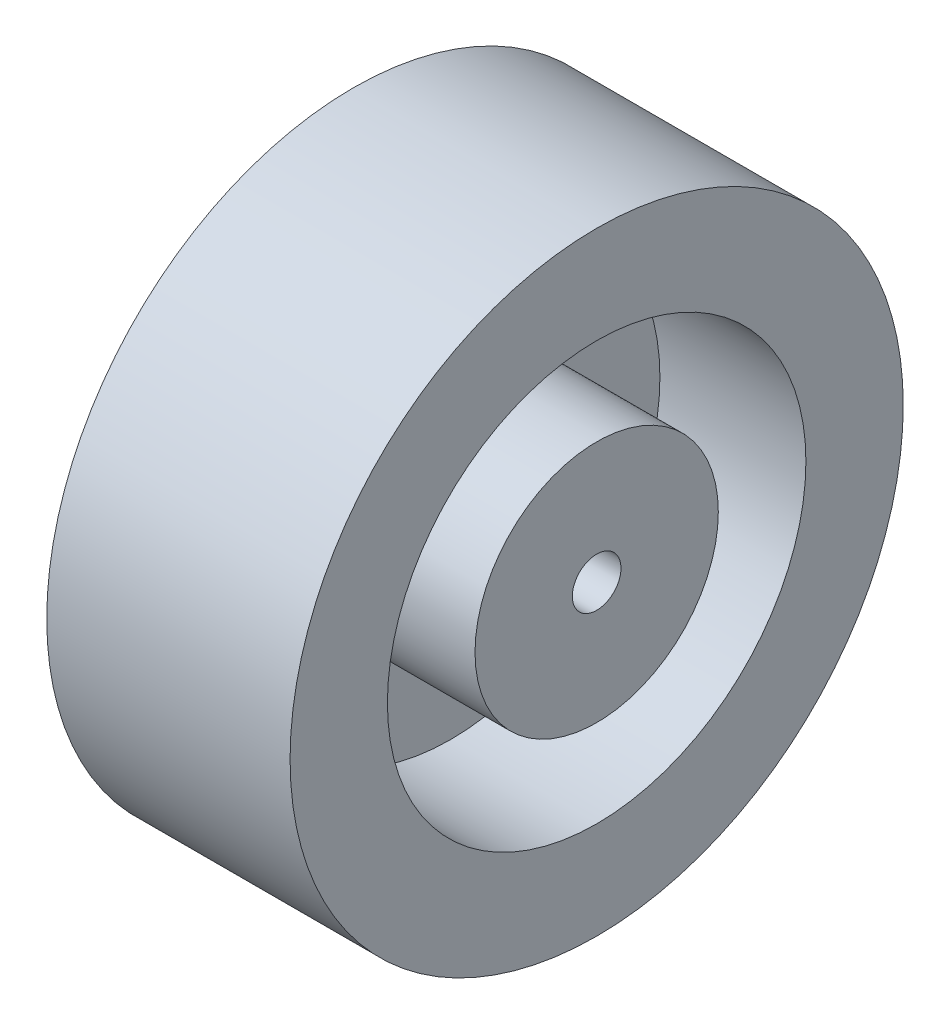
ISO-10303-21;
HEADER;
FILE_DESCRIPTION(('STEP AP214'),'2;1');
FILE_NAME('part.step','',(''),(''),'','','');
FILE_SCHEMA(('AUTOMOTIVE_DESIGN { 1 0 10303 214 1 1 1 1 }'));
ENDSEC;
DATA;
#1=APPLICATION_CONTEXT('core data for automotive mechanical design processes');
#2=APPLICATION_PROTOCOL_DEFINITION('international standard','automotive_design',2000,#1);
#3=PRODUCT_CONTEXT('',#1,'mechanical');
#4=PRODUCT('Part','Part','',(#3));
#5=PRODUCT_RELATED_PRODUCT_CATEGORY('part','',(#4));
#6=PRODUCT_DEFINITION_FORMATION('','',#4);
#7=PRODUCT_DEFINITION_CONTEXT('part definition',#1,'design');
#8=PRODUCT_DEFINITION('design','',#6,#7);
#9=PRODUCT_DEFINITION_SHAPE('','',#8);
#10=(LENGTH_UNIT() NAMED_UNIT(*) SI_UNIT(.MILLI.,.METRE.));
#11=(NAMED_UNIT(*) PLANE_ANGLE_UNIT() SI_UNIT($,.RADIAN.));
#12=(NAMED_UNIT(*) SI_UNIT($,.STERADIAN.) SOLID_ANGLE_UNIT());
#13=UNCERTAINTY_MEASURE_WITH_UNIT(LENGTH_MEASURE(1.E-05),#10,'distance_accuracy_value','');
#14=(GEOMETRIC_REPRESENTATION_CONTEXT(3) GLOBAL_UNCERTAINTY_ASSIGNED_CONTEXT((#13)) GLOBAL_UNIT_ASSIGNED_CONTEXT((#10,
#11,#12)) REPRESENTATION_CONTEXT('',''));
#15=CARTESIAN_POINT('',(0.,0.,0.));
#16=DIRECTION('',(0.,0.,1.));
#17=DIRECTION('',(1.,0.,0.));
#18=AXIS2_PLACEMENT_3D('',#15,#16,#17);
#19=CARTESIAN_POINT('',(25.,0.,0.));
#20=DIRECTION('',(1.,0.,0.));
#21=DIRECTION('',(0.,0.,-1.));
#22=AXIS2_PLACEMENT_3D('',#19,#20,#21);
#23=PLANE('',#22);
#24=CARTESIAN_POINT('',(25.,0.,0.));
#25=DIRECTION('',(1.,0.,0.));
#26=DIRECTION('',(0.,0.,-1.));
#27=AXIS2_PLACEMENT_3D('',#24,#25,#26);
#28=CIRCLE('',#27,12.5);
#29=CARTESIAN_POINT('',(25.,0.,-12.5));
#30=VERTEX_POINT('',#29);
#31=EDGE_CURVE('E65',#30,#30,#28,.F.);
#32=ORIENTED_EDGE('',*,*,#31,.F.);
#33=EDGE_LOOP('',(#32));
#34=FACE_BOUND('',#33,.T.);
#35=CARTESIAN_POINT('',(25.,0.,0.));
#36=DIRECTION('',(-1.,0.,0.));
#37=DIRECTION('',(0.,0.,1.));
#38=AXIS2_PLACEMENT_3D('',#35,#36,#37);
#39=CIRCLE('',#38,2.5);
#40=CARTESIAN_POINT('',(25.,0.,2.5));
#41=VERTEX_POINT('',#40);
#42=EDGE_CURVE('E57',#41,#41,#39,.T.);
#43=ORIENTED_EDGE('',*,*,#42,.T.);
#44=EDGE_LOOP('',(#43));
#45=FACE_BOUND('',#44,.T.);
#46=ADVANCED_FACE('F46',(#34,#45),#23,.T.);
#47=CARTESIAN_POINT('',(25.,0.,0.));
#48=DIRECTION('',(-1.,0.,0.));
#49=DIRECTION('',(0.,0.,1.));
#50=AXIS2_PLACEMENT_3D('',#47,#48,#49);
#51=CYLINDRICAL_SURFACE('',#50,31.5);
#52=CARTESIAN_POINT('',(25.,0.,0.));
#53=DIRECTION('',(1.,0.,0.));
#54=DIRECTION('',(0.,0.,-1.));
#55=AXIS2_PLACEMENT_3D('',#52,#53,#54);
#56=CIRCLE('',#55,31.5);
#57=CARTESIAN_POINT('',(25.,0.,-31.5));
#58=VERTEX_POINT('',#57);
#59=EDGE_CURVE('E10',#58,#58,#56,.T.);
#60=ORIENTED_EDGE('',*,*,#59,.F.);
#61=EDGE_LOOP('',(#60));
#62=FACE_BOUND('',#61,.T.);
#63=CARTESIAN_POINT('',(0.,0.,0.));
#64=DIRECTION('',(1.,0.,0.));
#65=DIRECTION('',(0.,0.,-1.));
#66=AXIS2_PLACEMENT_3D('',#63,#64,#65);
#67=CIRCLE('',#66,31.5);
#68=CARTESIAN_POINT('',(0.,0.,-31.5));
#69=VERTEX_POINT('',#68);
#70=EDGE_CURVE('E50',#69,#69,#67,.T.);
#71=ORIENTED_EDGE('',*,*,#70,.T.);
#72=EDGE_LOOP('',(#71));
#73=FACE_BOUND('',#72,.T.);
#74=ADVANCED_FACE('F48',(#62,#73),#51,.T.);
#75=CARTESIAN_POINT('',(25.,0.,0.));
#76=DIRECTION('',(1.,0.,0.));
#77=DIRECTION('',(0.,0.,-1.));
#78=AXIS2_PLACEMENT_3D('',#75,#76,#77);
#79=CIRCLE('',#78,21.5);
#80=CARTESIAN_POINT('',(25.,0.,-21.5));
#81=VERTEX_POINT('',#80);
#82=EDGE_CURVE('E62',#81,#81,#79,.T.);
#83=ORIENTED_EDGE('',*,*,#82,.F.);
#84=EDGE_LOOP('',(#83));
#85=FACE_BOUND('',#84,.T.);
#86=ORIENTED_EDGE('',*,*,#59,.T.);
#87=EDGE_LOOP('',(#86));
#88=FACE_BOUND('',#87,.T.);
#89=ADVANCED_FACE('F98',(#85,#88),#23,.T.);
#90=CARTESIAN_POINT('',(0.,0.,0.));
#91=DIRECTION('',(1.,0.,0.));
#92=DIRECTION('',(0.,0.,-1.));
#93=AXIS2_PLACEMENT_3D('',#90,#91,#92);
#94=PLANE('',#93);
#95=CARTESIAN_POINT('',(0.,0.,0.));
#96=DIRECTION('',(-1.,0.,0.));
#97=DIRECTION('',(0.,0.,1.));
#98=AXIS2_PLACEMENT_3D('',#95,#96,#97);
#99=CIRCLE('',#98,2.5);
#100=CARTESIAN_POINT('',(0.,0.,2.5));
#101=VERTEX_POINT('',#100);
#102=EDGE_CURVE('E59',#101,#101,#99,.T.);
#103=ORIENTED_EDGE('',*,*,#102,.F.);
#104=EDGE_LOOP('',(#103));
#105=FACE_BOUND('',#104,.T.);
#106=ORIENTED_EDGE('',*,*,#70,.F.);
#107=EDGE_LOOP('',(#106));
#108=FACE_BOUND('',#107,.T.);
#109=ADVANCED_FACE('F92',(#105,#108),#94,.F.);
#110=CARTESIAN_POINT('',(25.,0.,0.));
#111=DIRECTION('',(-1.,0.,0.));
#112=DIRECTION('',(0.,0.,1.));
#113=AXIS2_PLACEMENT_3D('',#110,#111,#112);
#114=CYLINDRICAL_SURFACE('',#113,2.5);
#115=ORIENTED_EDGE('',*,*,#42,.F.);
#116=EDGE_LOOP('',(#115));
#117=FACE_BOUND('',#116,.T.);
#118=ORIENTED_EDGE('',*,*,#102,.T.);
#119=EDGE_LOOP('',(#118));
#120=FACE_BOUND('',#119,.T.);
#121=ADVANCED_FACE('F81',(#117,#120),#114,.F.);
#122=CARTESIAN_POINT('',(25.,0.,0.));
#123=DIRECTION('',(-1.,0.,0.));
#124=DIRECTION('',(0.,0.,1.));
#125=AXIS2_PLACEMENT_3D('',#122,#123,#124);
#126=CYLINDRICAL_SURFACE('',#125,21.5);
#127=ORIENTED_EDGE('',*,*,#82,.T.);
#128=EDGE_LOOP('',(#127));
#129=FACE_BOUND('',#128,.T.);
#130=CARTESIAN_POINT('',(10.,0.,0.));
#131=DIRECTION('',(1.,0.,0.));
#132=DIRECTION('',(0.,0.,-1.));
#133=AXIS2_PLACEMENT_3D('',#130,#131,#132);
#134=CIRCLE('',#133,21.5);
#135=CARTESIAN_POINT('',(10.,0.,-21.5));
#136=VERTEX_POINT('',#135);
#137=EDGE_CURVE('E68',#136,#136,#134,.T.);
#138=ORIENTED_EDGE('',*,*,#137,.F.);
#139=EDGE_LOOP('',(#138));
#140=FACE_BOUND('',#139,.T.);
#141=ADVANCED_FACE('F79',(#129,#140),#126,.F.);
#142=CARTESIAN_POINT('',(10.,0.,0.));
#143=DIRECTION('',(1.,0.,0.));
#144=DIRECTION('',(0.,0.,-1.));
#145=AXIS2_PLACEMENT_3D('',#142,#143,#144);
#146=PLANE('',#145);
#147=CARTESIAN_POINT('',(10.,0.,0.));
#148=DIRECTION('',(1.,0.,0.));
#149=DIRECTION('',(0.,0.,-1.));
#150=AXIS2_PLACEMENT_3D('',#147,#148,#149);
#151=CIRCLE('',#150,12.5);
#152=CARTESIAN_POINT('',(10.,0.,-12.5));
#153=VERTEX_POINT('',#152);
#154=EDGE_CURVE('E69',#153,#153,#151,.F.);
#155=ORIENTED_EDGE('',*,*,#154,.T.);
#156=EDGE_LOOP('',(#155));
#157=FACE_BOUND('',#156,.T.);
#158=ORIENTED_EDGE('',*,*,#137,.T.);
#159=EDGE_LOOP('',(#158));
#160=FACE_BOUND('',#159,.T.);
#161=ADVANCED_FACE('F77',(#157,#160),#146,.T.);
#162=CARTESIAN_POINT('',(25.,0.,0.));
#163=DIRECTION('',(-1.,0.,0.));
#164=DIRECTION('',(0.,0.,1.));
#165=AXIS2_PLACEMENT_3D('',#162,#163,#164);
#166=CYLINDRICAL_SURFACE('',#165,12.5);
#167=ORIENTED_EDGE('',*,*,#31,.T.);
#168=EDGE_LOOP('',(#167));
#169=FACE_BOUND('',#168,.T.);
#170=ORIENTED_EDGE('',*,*,#154,.F.);
#171=EDGE_LOOP('',(#170));
#172=FACE_BOUND('',#171,.T.);
#173=ADVANCED_FACE('F88',(#169,#172),#166,.T.);
#174=CLOSED_SHELL('',(#46,#74,#89,#109,#121,#141,#161,#173));
#175=MANIFOLD_SOLID_BREP('B2',#174);
#176=ADVANCED_BREP_SHAPE_REPRESENTATION('',(#18,#175),#14);
#177=SHAPE_DEFINITION_REPRESENTATION(#9,#176);
ENDSEC;
END-ISO-10303-21;
